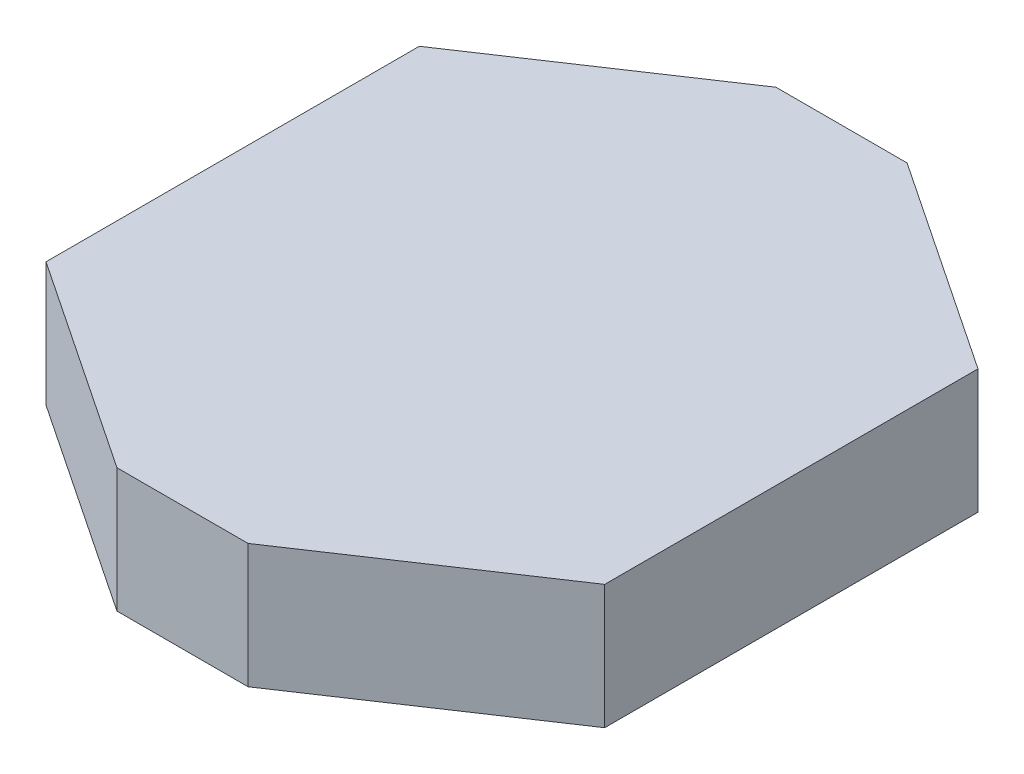
ISO-10303-21;
HEADER;
FILE_DESCRIPTION(('STEP AP214'),'2;1');
FILE_NAME('part.step','',(''),(''),'','','');
FILE_SCHEMA(('AUTOMOTIVE_DESIGN { 1 0 10303 214 1 1 1 1 }'));
ENDSEC;
DATA;
#1=APPLICATION_CONTEXT('core data for automotive mechanical design processes');
#2=APPLICATION_PROTOCOL_DEFINITION('international standard','automotive_design',2000,#1);
#3=PRODUCT_CONTEXT('',#1,'mechanical');
#4=PRODUCT('Part','Part','',(#3));
#5=PRODUCT_RELATED_PRODUCT_CATEGORY('part','',(#4));
#6=PRODUCT_DEFINITION_FORMATION('','',#4);
#7=PRODUCT_DEFINITION_CONTEXT('part definition',#1,'design');
#8=PRODUCT_DEFINITION('design','',#6,#7);
#9=PRODUCT_DEFINITION_SHAPE('','',#8);
#10=(LENGTH_UNIT() NAMED_UNIT(*) SI_UNIT(.MILLI.,.METRE.));
#11=(NAMED_UNIT(*) PLANE_ANGLE_UNIT() SI_UNIT($,.RADIAN.));
#12=(NAMED_UNIT(*) SI_UNIT($,.STERADIAN.) SOLID_ANGLE_UNIT());
#13=UNCERTAINTY_MEASURE_WITH_UNIT(LENGTH_MEASURE(1.E-05),#10,'distance_accuracy_value','');
#14=(GEOMETRIC_REPRESENTATION_CONTEXT(3) GLOBAL_UNCERTAINTY_ASSIGNED_CONTEXT((#13)) GLOBAL_UNIT_ASSIGNED_CONTEXT((#10,
#11,#12)) REPRESENTATION_CONTEXT('',''));
#15=CARTESIAN_POINT('',(0.,0.,0.));
#16=DIRECTION('',(0.,0.,1.));
#17=DIRECTION('',(1.,0.,0.));
#18=AXIS2_PLACEMENT_3D('',#15,#16,#17);
#19=CARTESIAN_POINT('',(-5.27910607256971,10.,-26.5398584417511));
#20=DIRECTION('',(0.,0.,1.));
#21=DIRECTION('',(1.,0.,0.));
#22=AXIS2_PLACEMENT_3D('',#19,#20,#21);
#23=PLANE('',#22);
#24=DIRECTION('',(-1.,0.,0.));
#25=VECTOR('',#24,1.);
#26=CARTESIAN_POINT('',(-5.27910607256971,0.,-26.5398584417511));
#27=LINE('',#26,#25);
#28=CARTESIAN_POINT('',(5.27910607256971,0.,-26.5398584417511));
#29=VERTEX_POINT('',#28);
#30=CARTESIAN_POINT('',(-5.27910607256971,0.,-26.5398584417511));
#31=VERTEX_POINT('',#30);
#32=EDGE_CURVE('E147',#29,#31,#27,.T.);
#33=ORIENTED_EDGE('',*,*,#32,.T.);
#34=DIRECTION('',(0.,-1.,0.));
#35=VECTOR('',#34,1.);
#36=CARTESIAN_POINT('',(-5.27910607256971,10.,-26.5398584417511));
#37=LINE('',#36,#35);
#38=CARTESIAN_POINT('',(-5.27910607256971,10.,-26.5398584417511));
#39=VERTEX_POINT('',#38);
#40=EDGE_CURVE('E12',#39,#31,#37,.T.);
#41=ORIENTED_EDGE('',*,*,#40,.F.);
#42=DIRECTION('',(-1.,0.,0.));
#43=VECTOR('',#42,1.);
#44=CARTESIAN_POINT('',(-5.27910607256971,10.,-26.5398584417511));
#45=LINE('',#44,#43);
#46=CARTESIAN_POINT('',(5.27910607256971,10.,-26.5398584417511));
#47=VERTEX_POINT('',#46);
#48=EDGE_CURVE('E161',#47,#39,#45,.T.);
#49=ORIENTED_EDGE('',*,*,#48,.F.);
#50=DIRECTION('',(0.,-1.,0.));
#51=VECTOR('',#50,1.);
#52=CARTESIAN_POINT('',(5.27910607256971,10.,-26.5398584417511));
#53=LINE('',#52,#51);
#54=EDGE_CURVE('E143',#47,#29,#53,.T.);
#55=ORIENTED_EDGE('',*,*,#54,.T.);
#56=EDGE_LOOP('',(#33,#41,#49,#55));
#57=FACE_BOUND('',#56,.T.);
#58=ADVANCED_FACE('F51',(#57),#23,.F.);
#59=CARTESIAN_POINT('',(-22.4994055784104,10.,-15.0336221733761));
#60=DIRECTION('',(0.555570233019602,0.,0.831469612302545));
#61=DIRECTION('',(0.831469612302545,0.,-0.555570233019602));
#62=AXIS2_PLACEMENT_3D('',#59,#60,#61);
#63=PLANE('',#62);
#64=DIRECTION('',(-0.831469612302545,0.,0.555570233019602));
#65=VECTOR('',#64,1.);
#66=CARTESIAN_POINT('',(-22.4994055784104,0.,-15.0336221733761));
#67=LINE('',#66,#65);
#68=CARTESIAN_POINT('',(-22.4994055784104,0.,-15.0336221733761));
#69=VERTEX_POINT('',#68);
#70=EDGE_CURVE('E150',#31,#69,#67,.T.);
#71=ORIENTED_EDGE('',*,*,#70,.T.);
#72=DIRECTION('',(0.,-1.,0.));
#73=VECTOR('',#72,1.);
#74=CARTESIAN_POINT('',(-22.4994055784104,10.,-15.0336221733761));
#75=LINE('',#74,#73);
#76=CARTESIAN_POINT('',(-22.4994055784104,10.,-15.0336221733761));
#77=VERTEX_POINT('',#76);
#78=EDGE_CURVE('E59',#77,#69,#75,.T.);
#79=ORIENTED_EDGE('',*,*,#78,.F.);
#80=DIRECTION('',(-0.831469612302545,0.,0.555570233019602));
#81=VECTOR('',#80,1.);
#82=CARTESIAN_POINT('',(-22.4994055784104,10.,-15.0336221733761));
#83=LINE('',#82,#81);
#84=EDGE_CURVE('E110',#39,#77,#83,.T.);
#85=ORIENTED_EDGE('',*,*,#84,.F.);
#86=ORIENTED_EDGE('',*,*,#40,.T.);
#87=EDGE_LOOP('',(#71,#79,#85,#86));
#88=FACE_BOUND('',#87,.T.);
#89=ADVANCED_FACE('F196',(#88),#63,.F.);
#90=CARTESIAN_POINT('',(-22.4994055784104,10.,15.0336221733761));
#91=DIRECTION('',(1.,0.,0.));
#92=DIRECTION('',(0.,0.,-1.));
#93=AXIS2_PLACEMENT_3D('',#90,#91,#92);
#94=PLANE('',#93);
#95=DIRECTION('',(0.,0.,1.));
#96=VECTOR('',#95,1.);
#97=CARTESIAN_POINT('',(-22.4994055784104,0.,15.0336221733761));
#98=LINE('',#97,#96);
#99=CARTESIAN_POINT('',(-22.4994055784104,0.,15.0336221733761));
#100=VERTEX_POINT('',#99);
#101=EDGE_CURVE('E152',#69,#100,#98,.T.);
#102=ORIENTED_EDGE('',*,*,#101,.T.);
#103=DIRECTION('',(0.,-1.,0.));
#104=VECTOR('',#103,1.);
#105=CARTESIAN_POINT('',(-22.4994055784104,10.,15.0336221733761));
#106=LINE('',#105,#104);
#107=CARTESIAN_POINT('',(-22.4994055784104,10.,15.0336221733761));
#108=VERTEX_POINT('',#107);
#109=EDGE_CURVE('E168',#108,#100,#106,.T.);
#110=ORIENTED_EDGE('',*,*,#109,.F.);
#111=DIRECTION('',(0.,0.,1.));
#112=VECTOR('',#111,1.);
#113=CARTESIAN_POINT('',(-22.4994055784104,10.,15.0336221733761));
#114=LINE('',#113,#112);
#115=EDGE_CURVE('E176',#77,#108,#114,.T.);
#116=ORIENTED_EDGE('',*,*,#115,.F.);
#117=ORIENTED_EDGE('',*,*,#78,.T.);
#118=EDGE_LOOP('',(#102,#110,#116,#117));
#119=FACE_BOUND('',#118,.T.);
#120=ADVANCED_FACE('F174',(#119),#94,.F.);
#121=CARTESIAN_POINT('',(-5.27910607256971,10.,26.5398584417511));
#122=DIRECTION('',(0.555570233019602,0.,-0.831469612302545));
#123=DIRECTION('',(-0.831469612302545,0.,-0.555570233019602));
#124=AXIS2_PLACEMENT_3D('',#121,#122,#123);
#125=PLANE('',#124);
#126=DIRECTION('',(0.831469612302545,0.,0.555570233019602));
#127=VECTOR('',#126,1.);
#128=CARTESIAN_POINT('',(-5.27910607256971,0.,26.5398584417511));
#129=LINE('',#128,#127);
#130=CARTESIAN_POINT('',(-5.27910607256971,0.,26.5398584417511));
#131=VERTEX_POINT('',#130);
#132=EDGE_CURVE('E154',#100,#131,#129,.T.);
#133=ORIENTED_EDGE('',*,*,#132,.T.);
#134=DIRECTION('',(0.,-1.,0.));
#135=VECTOR('',#134,1.);
#136=CARTESIAN_POINT('',(-5.27910607256971,10.,26.5398584417511));
#137=LINE('',#136,#135);
#138=CARTESIAN_POINT('',(-5.27910607256971,10.,26.5398584417511));
#139=VERTEX_POINT('',#138);
#140=EDGE_CURVE('E165',#139,#131,#137,.T.);
#141=ORIENTED_EDGE('',*,*,#140,.F.);
#142=DIRECTION('',(0.831469612302545,0.,0.555570233019602));
#143=VECTOR('',#142,1.);
#144=CARTESIAN_POINT('',(-5.27910607256971,10.,26.5398584417511));
#145=LINE('',#144,#143);
#146=EDGE_CURVE('E188',#108,#139,#145,.T.);
#147=ORIENTED_EDGE('',*,*,#146,.F.);
#148=ORIENTED_EDGE('',*,*,#109,.T.);
#149=EDGE_LOOP('',(#133,#141,#147,#148));
#150=FACE_BOUND('',#149,.T.);
#151=ADVANCED_FACE('F184',(#150),#125,.F.);
#152=CARTESIAN_POINT('',(5.27910607256971,10.,26.5398584417511));
#153=DIRECTION('',(0.,0.,-1.));
#154=DIRECTION('',(-1.,0.,0.));
#155=AXIS2_PLACEMENT_3D('',#152,#153,#154);
#156=PLANE('',#155);
#157=DIRECTION('',(1.,0.,0.));
#158=VECTOR('',#157,1.);
#159=CARTESIAN_POINT('',(5.27910607256971,0.,26.5398584417511));
#160=LINE('',#159,#158);
#161=CARTESIAN_POINT('',(5.27910607256971,0.,26.5398584417511));
#162=VERTEX_POINT('',#161);
#163=EDGE_CURVE('E156',#131,#162,#160,.T.);
#164=ORIENTED_EDGE('',*,*,#163,.T.);
#165=DIRECTION('',(0.,-1.,0.));
#166=VECTOR('',#165,1.);
#167=CARTESIAN_POINT('',(5.27910607256971,10.,26.5398584417511));
#168=LINE('',#167,#166);
#169=CARTESIAN_POINT('',(5.27910607256971,10.,26.5398584417511));
#170=VERTEX_POINT('',#169);
#171=EDGE_CURVE('E138',#170,#162,#168,.T.);
#172=ORIENTED_EDGE('',*,*,#171,.F.);
#173=DIRECTION('',(1.,0.,0.));
#174=VECTOR('',#173,1.);
#175=CARTESIAN_POINT('',(5.27910607256971,10.,26.5398584417511));
#176=LINE('',#175,#174);
#177=EDGE_CURVE('E129',#139,#170,#176,.T.);
#178=ORIENTED_EDGE('',*,*,#177,.F.);
#179=ORIENTED_EDGE('',*,*,#140,.T.);
#180=EDGE_LOOP('',(#164,#172,#178,#179));
#181=FACE_BOUND('',#180,.T.);
#182=ADVANCED_FACE('F187',(#181),#156,.F.);
#183=CARTESIAN_POINT('',(22.4994055784104,10.,15.0336221733761));
#184=DIRECTION('',(-0.555570233019602,0.,-0.831469612302545));
#185=DIRECTION('',(-0.831469612302545,0.,0.555570233019602));
#186=AXIS2_PLACEMENT_3D('',#183,#184,#185);
#187=PLANE('',#186);
#188=DIRECTION('',(0.831469612302546,0.,-0.555570233019602));
#189=VECTOR('',#188,1.);
#190=CARTESIAN_POINT('',(22.4994055784104,0.,15.0336221733761));
#191=LINE('',#190,#189);
#192=CARTESIAN_POINT('',(22.4994055784104,0.,15.0336221733761));
#193=VERTEX_POINT('',#192);
#194=EDGE_CURVE('E137',#162,#193,#191,.T.);
#195=ORIENTED_EDGE('',*,*,#194,.T.);
#196=DIRECTION('',(0.,-1.,0.));
#197=VECTOR('',#196,1.);
#198=CARTESIAN_POINT('',(22.4994055784104,10.,15.0336221733761));
#199=LINE('',#198,#197);
#200=CARTESIAN_POINT('',(22.4994055784104,10.,15.0336221733761));
#201=VERTEX_POINT('',#200);
#202=EDGE_CURVE('E134',#201,#193,#199,.T.);
#203=ORIENTED_EDGE('',*,*,#202,.F.);
#204=DIRECTION('',(0.831469612302546,0.,-0.555570233019602));
#205=VECTOR('',#204,1.);
#206=CARTESIAN_POINT('',(22.4994055784104,10.,15.0336221733761));
#207=LINE('',#206,#205);
#208=EDGE_CURVE('E123',#170,#201,#207,.T.);
#209=ORIENTED_EDGE('',*,*,#208,.F.);
#210=ORIENTED_EDGE('',*,*,#171,.T.);
#211=EDGE_LOOP('',(#195,#203,#209,#210));
#212=FACE_BOUND('',#211,.T.);
#213=ADVANCED_FACE('F135',(#212),#187,.F.);
#214=CARTESIAN_POINT('',(22.4994055784104,10.,-15.0336221733761));
#215=DIRECTION('',(-1.,0.,0.));
#216=DIRECTION('',(0.,0.,1.));
#217=AXIS2_PLACEMENT_3D('',#214,#215,#216);
#218=PLANE('',#217);
#219=DIRECTION('',(0.,0.,-1.));
#220=VECTOR('',#219,1.);
#221=CARTESIAN_POINT('',(22.4994055784104,0.,-15.0336221733761));
#222=LINE('',#221,#220);
#223=CARTESIAN_POINT('',(22.4994055784104,0.,-15.0336221733761));
#224=VERTEX_POINT('',#223);
#225=EDGE_CURVE('E96',#193,#224,#222,.T.);
#226=ORIENTED_EDGE('',*,*,#225,.T.);
#227=DIRECTION('',(0.,-1.,0.));
#228=VECTOR('',#227,1.);
#229=CARTESIAN_POINT('',(22.4994055784104,10.,-15.0336221733761));
#230=LINE('',#229,#228);
#231=CARTESIAN_POINT('',(22.4994055784104,10.,-15.0336221733761));
#232=VERTEX_POINT('',#231);
#233=EDGE_CURVE('E139',#232,#224,#230,.T.);
#234=ORIENTED_EDGE('',*,*,#233,.F.);
#235=DIRECTION('',(0.,0.,-1.));
#236=VECTOR('',#235,1.);
#237=CARTESIAN_POINT('',(22.4994055784104,10.,-15.0336221733761));
#238=LINE('',#237,#236);
#239=EDGE_CURVE('E127',#201,#232,#238,.T.);
#240=ORIENTED_EDGE('',*,*,#239,.F.);
#241=ORIENTED_EDGE('',*,*,#202,.T.);
#242=EDGE_LOOP('',(#226,#234,#240,#241));
#243=FACE_BOUND('',#242,.T.);
#244=ADVANCED_FACE('F141',(#243),#218,.F.);
#245=CARTESIAN_POINT('',(5.27910607256971,10.,-26.5398584417511));
#246=DIRECTION('',(-0.555570233019602,0.,0.831469612302545));
#247=DIRECTION('',(0.831469612302545,0.,0.555570233019602));
#248=AXIS2_PLACEMENT_3D('',#245,#246,#247);
#249=PLANE('',#248);
#250=DIRECTION('',(-0.831469612302546,0.,-0.555570233019602));
#251=VECTOR('',#250,1.);
#252=CARTESIAN_POINT('',(5.27910607256971,0.,-26.5398584417511));
#253=LINE('',#252,#251);
#254=EDGE_CURVE('E102',#224,#29,#253,.T.);
#255=ORIENTED_EDGE('',*,*,#254,.T.);
#256=ORIENTED_EDGE('',*,*,#54,.F.);
#257=DIRECTION('',(-0.831469612302546,0.,-0.555570233019602));
#258=VECTOR('',#257,1.);
#259=CARTESIAN_POINT('',(5.27910607256971,10.,-26.5398584417511));
#260=LINE('',#259,#258);
#261=EDGE_CURVE('E67',#232,#47,#260,.T.);
#262=ORIENTED_EDGE('',*,*,#261,.F.);
#263=ORIENTED_EDGE('',*,*,#233,.T.);
#264=EDGE_LOOP('',(#255,#256,#262,#263));
#265=FACE_BOUND('',#264,.T.);
#266=ADVANCED_FACE('F212',(#265),#249,.F.);
#267=CARTESIAN_POINT('',(0.,10.,0.));
#268=DIRECTION('',(0.,-1.,0.));
#269=DIRECTION('',(0.,0.,-1.));
#270=AXIS2_PLACEMENT_3D('',#267,#268,#269);
#271=PLANE('',#270);
#272=ORIENTED_EDGE('',*,*,#48,.T.);
#273=ORIENTED_EDGE('',*,*,#84,.T.);
#274=ORIENTED_EDGE('',*,*,#115,.T.);
#275=ORIENTED_EDGE('',*,*,#146,.T.);
#276=ORIENTED_EDGE('',*,*,#177,.T.);
#277=ORIENTED_EDGE('',*,*,#208,.T.);
#278=ORIENTED_EDGE('',*,*,#239,.T.);
#279=ORIENTED_EDGE('',*,*,#261,.T.);
#280=EDGE_LOOP('',(#272,#273,#274,#275,#276,#277,#278,#279));
#281=FACE_BOUND('',#280,.T.);
#282=ADVANCED_FACE('F125',(#281),#271,.F.);
#283=CARTESIAN_POINT('',(0.,0.,0.));
#284=DIRECTION('',(0.,-1.,0.));
#285=DIRECTION('',(0.,0.,-1.));
#286=AXIS2_PLACEMENT_3D('',#283,#284,#285);
#287=PLANE('',#286);
#288=ORIENTED_EDGE('',*,*,#32,.F.);
#289=ORIENTED_EDGE('',*,*,#254,.F.);
#290=ORIENTED_EDGE('',*,*,#225,.F.);
#291=ORIENTED_EDGE('',*,*,#194,.F.);
#292=ORIENTED_EDGE('',*,*,#163,.F.);
#293=ORIENTED_EDGE('',*,*,#132,.F.);
#294=ORIENTED_EDGE('',*,*,#101,.F.);
#295=ORIENTED_EDGE('',*,*,#70,.F.);
#296=EDGE_LOOP('',(#288,#289,#290,#291,#292,#293,#294,#295));
#297=FACE_BOUND('',#296,.T.);
#298=ADVANCED_FACE('F180',(#297),#287,.T.);
#299=CLOSED_SHELL('',(#58,#89,#120,#151,#182,#213,#244,#266,#282,#298));
#300=MANIFOLD_SOLID_BREP('B2',#299);
#301=CARTESIAN_POINT('',(-5.27910607256971,10.,-26.5398584417511));
#302=DIRECTION('',(0.,0.,1.));
#303=DIRECTION('',(1.,0.,0.));
#304=AXIS2_PLACEMENT_3D('',#301,#302,#303);
#305=PLANE('',#304);
#306=DIRECTION('',(-1.,0.,0.));
#307=VECTOR('',#306,1.);
#308=CARTESIAN_POINT('',(-5.27910607256971,0.,-26.5398584417511));
#309=LINE('',#308,#307);
#310=CARTESIAN_POINT('',(5.27910607256971,0.,-26.5398584417511));
#311=VERTEX_POINT('',#310);
#312=CARTESIAN_POINT('',(-5.27910607256971,0.,-26.5398584417511));
#313=VERTEX_POINT('',#312);
#314=EDGE_CURVE('E375',#311,#313,#309,.T.);
#315=ORIENTED_EDGE('',*,*,#314,.T.);
#316=DIRECTION('',(0.,-1.,0.));
#317=VECTOR('',#316,1.);
#318=CARTESIAN_POINT('',(-5.27910607256971,10.,-26.5398584417511));
#319=LINE('',#318,#317);
#320=CARTESIAN_POINT('',(-5.27910607256971,10.,-26.5398584417511));
#321=VERTEX_POINT('',#320);
#322=EDGE_CURVE('E49',#321,#313,#319,.T.);
#323=ORIENTED_EDGE('',*,*,#322,.F.);
#324=DIRECTION('',(-1.,0.,0.));
#325=VECTOR('',#324,1.);
#326=CARTESIAN_POINT('',(-5.27910607256971,10.,-26.5398584417511));
#327=LINE('',#326,#325);
#328=CARTESIAN_POINT('',(5.27910607256971,10.,-26.5398584417511));
#329=VERTEX_POINT('',#328);
#330=EDGE_CURVE('E389',#329,#321,#327,.T.);
#331=ORIENTED_EDGE('',*,*,#330,.F.);
#332=DIRECTION('',(0.,-1.,0.));
#333=VECTOR('',#332,1.);
#334=CARTESIAN_POINT('',(5.27910607256971,10.,-26.5398584417511));
#335=LINE('',#334,#333);
#336=EDGE_CURVE('E371',#329,#311,#335,.T.);
#337=ORIENTED_EDGE('',*,*,#336,.T.);
#338=EDGE_LOOP('',(#315,#323,#331,#337));
#339=FACE_BOUND('',#338,.T.);
#340=ADVANCED_FACE('F279',(#339),#305,.F.);
#341=CARTESIAN_POINT('',(-22.4994055784104,10.,-15.0336221733761));
#342=DIRECTION('',(0.555570233019602,0.,0.831469612302545));
#343=DIRECTION('',(0.831469612302545,0.,-0.555570233019602));
#344=AXIS2_PLACEMENT_3D('',#341,#342,#343);
#345=PLANE('',#344);
#346=DIRECTION('',(-0.831469612302545,0.,0.555570233019602));
#347=VECTOR('',#346,1.);
#348=CARTESIAN_POINT('',(-22.4994055784104,0.,-15.0336221733761));
#349=LINE('',#348,#347);
#350=CARTESIAN_POINT('',(-22.4994055784104,0.,-15.0336221733761));
#351=VERTEX_POINT('',#350);
#352=EDGE_CURVE('E378',#313,#351,#349,.T.);
#353=ORIENTED_EDGE('',*,*,#352,.T.);
#354=DIRECTION('',(0.,-1.,0.));
#355=VECTOR('',#354,1.);
#356=CARTESIAN_POINT('',(-22.4994055784104,10.,-15.0336221733761));
#357=LINE('',#356,#355);
#358=CARTESIAN_POINT('',(-22.4994055784104,10.,-15.0336221733761));
#359=VERTEX_POINT('',#358);
#360=EDGE_CURVE('E287',#359,#351,#357,.T.);
#361=ORIENTED_EDGE('',*,*,#360,.F.);
#362=DIRECTION('',(-0.831469612302545,0.,0.555570233019602));
#363=VECTOR('',#362,1.);
#364=CARTESIAN_POINT('',(-22.4994055784104,10.,-15.0336221733761));
#365=LINE('',#364,#363);
#366=EDGE_CURVE('E338',#321,#359,#365,.T.);
#367=ORIENTED_EDGE('',*,*,#366,.F.);
#368=ORIENTED_EDGE('',*,*,#322,.T.);
#369=EDGE_LOOP('',(#353,#361,#367,#368));
#370=FACE_BOUND('',#369,.T.);
#371=ADVANCED_FACE('F424',(#370),#345,.F.);
#372=CARTESIAN_POINT('',(-22.4994055784104,10.,15.0336221733761));
#373=DIRECTION('',(1.,0.,0.));
#374=DIRECTION('',(0.,0.,-1.));
#375=AXIS2_PLACEMENT_3D('',#372,#373,#374);
#376=PLANE('',#375);
#377=DIRECTION('',(0.,0.,1.));
#378=VECTOR('',#377,1.);
#379=CARTESIAN_POINT('',(-22.4994055784104,0.,15.0336221733761));
#380=LINE('',#379,#378);
#381=CARTESIAN_POINT('',(-22.4994055784104,0.,15.0336221733761));
#382=VERTEX_POINT('',#381);
#383=EDGE_CURVE('E380',#351,#382,#380,.T.);
#384=ORIENTED_EDGE('',*,*,#383,.T.);
#385=DIRECTION('',(0.,-1.,0.));
#386=VECTOR('',#385,1.);
#387=CARTESIAN_POINT('',(-22.4994055784104,10.,15.0336221733761));
#388=LINE('',#387,#386);
#389=CARTESIAN_POINT('',(-22.4994055784104,10.,15.0336221733761));
#390=VERTEX_POINT('',#389);
#391=EDGE_CURVE('E396',#390,#382,#388,.T.);
#392=ORIENTED_EDGE('',*,*,#391,.F.);
#393=DIRECTION('',(0.,0.,1.));
#394=VECTOR('',#393,1.);
#395=CARTESIAN_POINT('',(-22.4994055784104,10.,15.0336221733761));
#396=LINE('',#395,#394);
#397=EDGE_CURVE('E404',#359,#390,#396,.T.);
#398=ORIENTED_EDGE('',*,*,#397,.F.);
#399=ORIENTED_EDGE('',*,*,#360,.T.);
#400=EDGE_LOOP('',(#384,#392,#398,#399));
#401=FACE_BOUND('',#400,.T.);
#402=ADVANCED_FACE('F402',(#401),#376,.F.);
#403=CARTESIAN_POINT('',(-5.27910607256971,10.,26.5398584417511));
#404=DIRECTION('',(0.555570233019602,0.,-0.831469612302545));
#405=DIRECTION('',(-0.831469612302545,0.,-0.555570233019602));
#406=AXIS2_PLACEMENT_3D('',#403,#404,#405);
#407=PLANE('',#406);
#408=DIRECTION('',(0.831469612302545,0.,0.555570233019602));
#409=VECTOR('',#408,1.);
#410=CARTESIAN_POINT('',(-5.27910607256971,0.,26.5398584417511));
#411=LINE('',#410,#409);
#412=CARTESIAN_POINT('',(-5.27910607256971,0.,26.5398584417511));
#413=VERTEX_POINT('',#412);
#414=EDGE_CURVE('E382',#382,#413,#411,.T.);
#415=ORIENTED_EDGE('',*,*,#414,.T.);
#416=DIRECTION('',(0.,-1.,0.));
#417=VECTOR('',#416,1.);
#418=CARTESIAN_POINT('',(-5.27910607256971,10.,26.5398584417511));
#419=LINE('',#418,#417);
#420=CARTESIAN_POINT('',(-5.27910607256971,10.,26.5398584417511));
#421=VERTEX_POINT('',#420);
#422=EDGE_CURVE('E393',#421,#413,#419,.T.);
#423=ORIENTED_EDGE('',*,*,#422,.F.);
#424=DIRECTION('',(0.831469612302545,0.,0.555570233019602));
#425=VECTOR('',#424,1.);
#426=CARTESIAN_POINT('',(-5.27910607256971,10.,26.5398584417511));
#427=LINE('',#426,#425);
#428=EDGE_CURVE('E416',#390,#421,#427,.T.);
#429=ORIENTED_EDGE('',*,*,#428,.F.);
#430=ORIENTED_EDGE('',*,*,#391,.T.);
#431=EDGE_LOOP('',(#415,#423,#429,#430));
#432=FACE_BOUND('',#431,.T.);
#433=ADVANCED_FACE('F412',(#432),#407,.F.);
#434=CARTESIAN_POINT('',(5.27910607256971,10.,26.5398584417511));
#435=DIRECTION('',(0.,0.,-1.));
#436=DIRECTION('',(-1.,0.,0.));
#437=AXIS2_PLACEMENT_3D('',#434,#435,#436);
#438=PLANE('',#437);
#439=DIRECTION('',(1.,0.,0.));
#440=VECTOR('',#439,1.);
#441=CARTESIAN_POINT('',(5.27910607256971,0.,26.5398584417511));
#442=LINE('',#441,#440);
#443=CARTESIAN_POINT('',(5.27910607256971,0.,26.5398584417511));
#444=VERTEX_POINT('',#443);
#445=EDGE_CURVE('E384',#413,#444,#442,.T.);
#446=ORIENTED_EDGE('',*,*,#445,.T.);
#447=DIRECTION('',(0.,-1.,0.));
#448=VECTOR('',#447,1.);
#449=CARTESIAN_POINT('',(5.27910607256971,10.,26.5398584417511));
#450=LINE('',#449,#448);
#451=CARTESIAN_POINT('',(5.27910607256971,10.,26.5398584417511));
#452=VERTEX_POINT('',#451);
#453=EDGE_CURVE('E366',#452,#444,#450,.T.);
#454=ORIENTED_EDGE('',*,*,#453,.F.);
#455=DIRECTION('',(1.,0.,0.));
#456=VECTOR('',#455,1.);
#457=CARTESIAN_POINT('',(5.27910607256971,10.,26.5398584417511));
#458=LINE('',#457,#456);
#459=EDGE_CURVE('E357',#421,#452,#458,.T.);
#460=ORIENTED_EDGE('',*,*,#459,.F.);
#461=ORIENTED_EDGE('',*,*,#422,.T.);
#462=EDGE_LOOP('',(#446,#454,#460,#461));
#463=FACE_BOUND('',#462,.T.);
#464=ADVANCED_FACE('F415',(#463),#438,.F.);
#465=CARTESIAN_POINT('',(22.4994055784104,10.,15.0336221733761));
#466=DIRECTION('',(-0.555570233019602,0.,-0.831469612302545));
#467=DIRECTION('',(-0.831469612302545,0.,0.555570233019602));
#468=AXIS2_PLACEMENT_3D('',#465,#466,#467);
#469=PLANE('',#468);
#470=DIRECTION('',(0.831469612302546,0.,-0.555570233019602));
#471=VECTOR('',#470,1.);
#472=CARTESIAN_POINT('',(22.4994055784104,0.,15.0336221733761));
#473=LINE('',#472,#471);
#474=CARTESIAN_POINT('',(22.4994055784104,0.,15.0336221733761));
#475=VERTEX_POINT('',#474);
#476=EDGE_CURVE('E365',#444,#475,#473,.T.);
#477=ORIENTED_EDGE('',*,*,#476,.T.);
#478=DIRECTION('',(0.,-1.,0.));
#479=VECTOR('',#478,1.);
#480=CARTESIAN_POINT('',(22.4994055784104,10.,15.0336221733761));
#481=LINE('',#480,#479);
#482=CARTESIAN_POINT('',(22.4994055784104,10.,15.0336221733761));
#483=VERTEX_POINT('',#482);
#484=EDGE_CURVE('E362',#483,#475,#481,.T.);
#485=ORIENTED_EDGE('',*,*,#484,.F.);
#486=DIRECTION('',(0.831469612302546,0.,-0.555570233019602));
#487=VECTOR('',#486,1.);
#488=CARTESIAN_POINT('',(22.4994055784104,10.,15.0336221733761));
#489=LINE('',#488,#487);
#490=EDGE_CURVE('E351',#452,#483,#489,.T.);
#491=ORIENTED_EDGE('',*,*,#490,.F.);
#492=ORIENTED_EDGE('',*,*,#453,.T.);
#493=EDGE_LOOP('',(#477,#485,#491,#492));
#494=FACE_BOUND('',#493,.T.);
#495=ADVANCED_FACE('F363',(#494),#469,.F.);
#496=CARTESIAN_POINT('',(22.4994055784104,10.,-15.0336221733761));
#497=DIRECTION('',(-1.,0.,0.));
#498=DIRECTION('',(0.,0.,1.));
#499=AXIS2_PLACEMENT_3D('',#496,#497,#498);
#500=PLANE('',#499);
#501=DIRECTION('',(0.,0.,-1.));
#502=VECTOR('',#501,1.);
#503=CARTESIAN_POINT('',(22.4994055784104,0.,-15.0336221733761));
#504=LINE('',#503,#502);
#505=CARTESIAN_POINT('',(22.4994055784104,0.,-15.0336221733761));
#506=VERTEX_POINT('',#505);
#507=EDGE_CURVE('E324',#475,#506,#504,.T.);
#508=ORIENTED_EDGE('',*,*,#507,.T.);
#509=DIRECTION('',(0.,-1.,0.));
#510=VECTOR('',#509,1.);
#511=CARTESIAN_POINT('',(22.4994055784104,10.,-15.0336221733761));
#512=LINE('',#511,#510);
#513=CARTESIAN_POINT('',(22.4994055784104,10.,-15.0336221733761));
#514=VERTEX_POINT('',#513);
#515=EDGE_CURVE('E367',#514,#506,#512,.T.);
#516=ORIENTED_EDGE('',*,*,#515,.F.);
#517=DIRECTION('',(0.,0.,-1.));
#518=VECTOR('',#517,1.);
#519=CARTESIAN_POINT('',(22.4994055784104,10.,-15.0336221733761));
#520=LINE('',#519,#518);
#521=EDGE_CURVE('E355',#483,#514,#520,.T.);
#522=ORIENTED_EDGE('',*,*,#521,.F.);
#523=ORIENTED_EDGE('',*,*,#484,.T.);
#524=EDGE_LOOP('',(#508,#516,#522,#523));
#525=FACE_BOUND('',#524,.T.);
#526=ADVANCED_FACE('F369',(#525),#500,.F.);
#527=CARTESIAN_POINT('',(5.27910607256971,10.,-26.5398584417511));
#528=DIRECTION('',(-0.555570233019602,0.,0.831469612302545));
#529=DIRECTION('',(0.831469612302545,0.,0.555570233019602));
#530=AXIS2_PLACEMENT_3D('',#527,#528,#529);
#531=PLANE('',#530);
#532=DIRECTION('',(-0.831469612302546,0.,-0.555570233019602));
#533=VECTOR('',#532,1.);
#534=CARTESIAN_POINT('',(5.27910607256971,0.,-26.5398584417511));
#535=LINE('',#534,#533);
#536=EDGE_CURVE('E330',#506,#311,#535,.T.);
#537=ORIENTED_EDGE('',*,*,#536,.T.);
#538=ORIENTED_EDGE('',*,*,#336,.F.);
#539=DIRECTION('',(-0.831469612302546,0.,-0.555570233019602));
#540=VECTOR('',#539,1.);
#541=CARTESIAN_POINT('',(5.27910607256971,10.,-26.5398584417511));
#542=LINE('',#541,#540);
#543=EDGE_CURVE('E295',#514,#329,#542,.T.);
#544=ORIENTED_EDGE('',*,*,#543,.F.);
#545=ORIENTED_EDGE('',*,*,#515,.T.);
#546=EDGE_LOOP('',(#537,#538,#544,#545));
#547=FACE_BOUND('',#546,.T.);
#548=ADVANCED_FACE('F440',(#547),#531,.F.);
#549=CARTESIAN_POINT('',(0.,10.,0.));
#550=DIRECTION('',(0.,-1.,0.));
#551=DIRECTION('',(0.,0.,-1.));
#552=AXIS2_PLACEMENT_3D('',#549,#550,#551);
#553=PLANE('',#552);
#554=ORIENTED_EDGE('',*,*,#330,.T.);
#555=ORIENTED_EDGE('',*,*,#366,.T.);
#556=ORIENTED_EDGE('',*,*,#397,.T.);
#557=ORIENTED_EDGE('',*,*,#428,.T.);
#558=ORIENTED_EDGE('',*,*,#459,.T.);
#559=ORIENTED_EDGE('',*,*,#490,.T.);
#560=ORIENTED_EDGE('',*,*,#521,.T.);
#561=ORIENTED_EDGE('',*,*,#543,.T.);
#562=EDGE_LOOP('',(#554,#555,#556,#557,#558,#559,#560,#561));
#563=FACE_BOUND('',#562,.T.);
#564=ADVANCED_FACE('F353',(#563),#553,.F.);
#565=CARTESIAN_POINT('',(0.,0.,0.));
#566=DIRECTION('',(0.,-1.,0.));
#567=DIRECTION('',(0.,0.,-1.));
#568=AXIS2_PLACEMENT_3D('',#565,#566,#567);
#569=PLANE('',#568);
#570=ORIENTED_EDGE('',*,*,#314,.F.);
#571=ORIENTED_EDGE('',*,*,#536,.F.);
#572=ORIENTED_EDGE('',*,*,#507,.F.);
#573=ORIENTED_EDGE('',*,*,#476,.F.);
#574=ORIENTED_EDGE('',*,*,#445,.F.);
#575=ORIENTED_EDGE('',*,*,#414,.F.);
#576=ORIENTED_EDGE('',*,*,#383,.F.);
#577=ORIENTED_EDGE('',*,*,#352,.F.);
#578=EDGE_LOOP('',(#570,#571,#572,#573,#574,#575,#576,#577));
#579=FACE_BOUND('',#578,.T.);
#580=ADVANCED_FACE('F408',(#579),#569,.T.);
#581=CLOSED_SHELL('',(#340,#371,#402,#433,#464,#495,#526,#548,#564,#580));
#582=MANIFOLD_SOLID_BREP('B6',#581);
#583=ADVANCED_BREP_SHAPE_REPRESENTATION('',(#18,#300,#582),#14);
#584=SHAPE_DEFINITION_REPRESENTATION(#9,#583);
ENDSEC;
END-ISO-10303-21;
